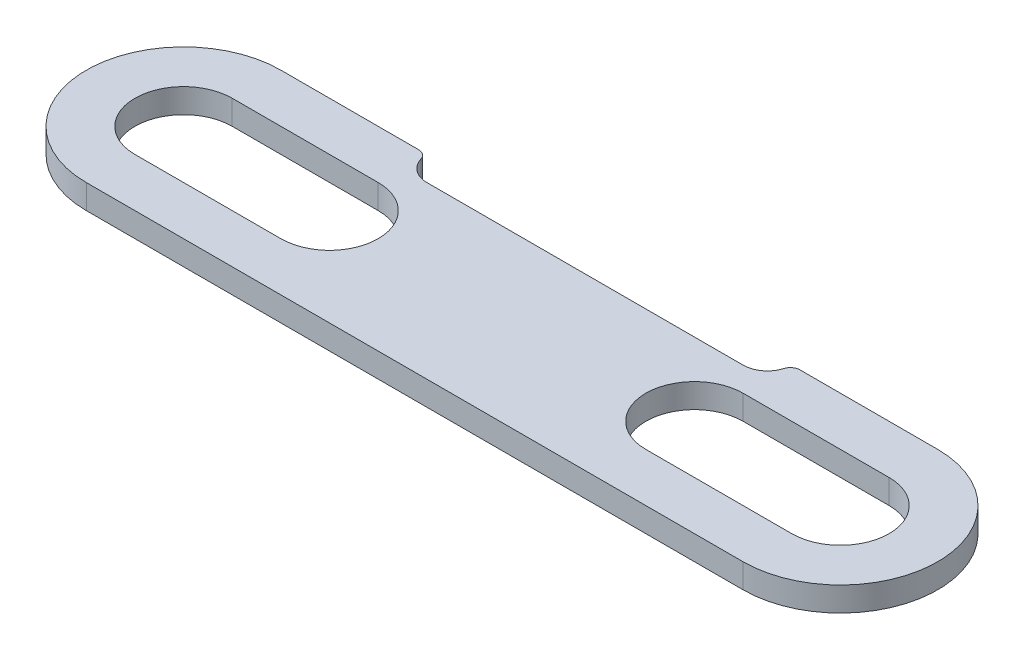
ISO-10303-21;
HEADER;
FILE_DESCRIPTION(('STEP AP214'),'2;1');
FILE_NAME('part.step','',(''),(''),'','','');
FILE_SCHEMA(('AUTOMOTIVE_DESIGN { 1 0 10303 214 1 1 1 1 }'));
ENDSEC;
DATA;
#1=APPLICATION_CONTEXT('core data for automotive mechanical design processes');
#2=APPLICATION_PROTOCOL_DEFINITION('international standard','automotive_design',2000,#1);
#3=PRODUCT_CONTEXT('',#1,'mechanical');
#4=PRODUCT('Part','Part','',(#3));
#5=PRODUCT_RELATED_PRODUCT_CATEGORY('part','',(#4));
#6=PRODUCT_DEFINITION_FORMATION('','',#4);
#7=PRODUCT_DEFINITION_CONTEXT('part definition',#1,'design');
#8=PRODUCT_DEFINITION('design','',#6,#7);
#9=PRODUCT_DEFINITION_SHAPE('','',#8);
#10=(LENGTH_UNIT() NAMED_UNIT(*) SI_UNIT(.MILLI.,.METRE.));
#11=(NAMED_UNIT(*) PLANE_ANGLE_UNIT() SI_UNIT($,.RADIAN.));
#12=(NAMED_UNIT(*) SI_UNIT($,.STERADIAN.) SOLID_ANGLE_UNIT());
#13=UNCERTAINTY_MEASURE_WITH_UNIT(LENGTH_MEASURE(1.E-05),#10,'distance_accuracy_value','');
#14=(GEOMETRIC_REPRESENTATION_CONTEXT(3) GLOBAL_UNCERTAINTY_ASSIGNED_CONTEXT((#13)) GLOBAL_UNIT_ASSIGNED_CONTEXT((#10,
#11,#12)) REPRESENTATION_CONTEXT('',''));
#15=CARTESIAN_POINT('',(0.,0.,0.));
#16=DIRECTION('',(0.,0.,1.));
#17=DIRECTION('',(1.,0.,0.));
#18=AXIS2_PLACEMENT_3D('',#15,#16,#17);
#19=CARTESIAN_POINT('',(-85.725,3.175,-25.4));
#20=DIRECTION('',(0.,0.,1.));
#21=DIRECTION('',(1.,0.,0.));
#22=AXIS2_PLACEMENT_3D('',#19,#20,#21);
#23=PLANE('',#22);
#24=DIRECTION('',(-1.,0.,0.));
#25=VECTOR('',#24,1.);
#26=CARTESIAN_POINT('',(-85.725,3.175,-25.4));
#27=LINE('',#26,#25);
#28=CARTESIAN_POINT('',(-49.7944189942742,3.175,-25.4));
#29=VERTEX_POINT('',#28);
#30=CARTESIAN_POINT('',(-85.725,3.175,-25.4));
#31=VERTEX_POINT('',#30);
#32=EDGE_CURVE('E260',#29,#31,#27,.T.);
#33=ORIENTED_EDGE('',*,*,#32,.F.);
#34=DIRECTION('',(0.,1.,0.));
#35=VECTOR('',#34,1.);
#36=CARTESIAN_POINT('',(-49.7944189942742,3.175,-25.4));
#37=LINE('',#36,#35);
#38=CARTESIAN_POINT('',(-49.7944189942742,-3.175,-25.4));
#39=VERTEX_POINT('',#38);
#40=EDGE_CURVE('E11',#29,#39,#37,.F.);
#41=ORIENTED_EDGE('',*,*,#40,.T.);
#42=DIRECTION('',(-1.,0.,0.));
#43=VECTOR('',#42,1.);
#44=CARTESIAN_POINT('',(-85.725,-3.175,-25.4));
#45=LINE('',#44,#43);
#46=CARTESIAN_POINT('',(-85.725,-3.175,-25.4));
#47=VERTEX_POINT('',#46);
#48=EDGE_CURVE('E271',#39,#47,#45,.T.);
#49=ORIENTED_EDGE('',*,*,#48,.T.);
#50=DIRECTION('',(0.,-1.,0.));
#51=VECTOR('',#50,1.);
#52=CARTESIAN_POINT('',(-85.725,3.175,-25.4));
#53=LINE('',#52,#51);
#54=EDGE_CURVE('E264',#31,#47,#53,.T.);
#55=ORIENTED_EDGE('',*,*,#54,.F.);
#56=EDGE_LOOP('',(#33,#41,#49,#55));
#57=FACE_BOUND('',#56,.T.);
#58=ADVANCED_FACE('F33',(#57),#23,.F.);
#59=CARTESIAN_POINT('',(-85.725,3.175,0.));
#60=DIRECTION('',(0.,1.,0.));
#61=DIRECTION('',(0.,0.,1.));
#62=AXIS2_PLACEMENT_3D('',#59,#60,#61);
#63=PLANE('',#62);
#64=CARTESIAN_POINT('',(85.725,3.175,-25.4000000000001));
#65=VERTEX_POINT('',#64);
#66=CARTESIAN_POINT('',(49.7944189942742,3.175,-25.4));
#67=VERTEX_POINT('',#66);
#68=EDGE_CURVE('E261',#65,#67,#27,.T.);
#69=ORIENTED_EDGE('',*,*,#68,.T.);
#70=CARTESIAN_POINT('',(49.7944189942742,3.175,-22.86));
#71=DIRECTION('',(0.,1.,0.));
#72=DIRECTION('',(0.,0.,1.));
#73=AXIS2_PLACEMENT_3D('',#70,#71,#72);
#74=CIRCLE('',#73,2.54);
#75=CARTESIAN_POINT('',(47.3602992816244,3.175,-23.5857142857143));
#76=VERTEX_POINT('',#75);
#77=EDGE_CURVE('E290',#67,#76,#74,.T.);
#78=ORIENTED_EDGE('',*,*,#77,.T.);
#79=CARTESIAN_POINT('',(41.275,3.175,-25.4));
#80=DIRECTION('',(0.,1.,0.));
#81=DIRECTION('',(0.,0.,1.));
#82=AXIS2_PLACEMENT_3D('',#79,#80,#81);
#83=CIRCLE('',#82,6.35);
#84=CARTESIAN_POINT('',(41.275,3.175,-19.05));
#85=VERTEX_POINT('',#84);
#86=EDGE_CURVE('E165',#85,#76,#83,.T.);
#87=ORIENTED_EDGE('',*,*,#86,.F.);
#88=DIRECTION('',(1.,0.,0.));
#89=VECTOR('',#88,1.);
#90=CARTESIAN_POINT('',(-41.275,3.175,-19.05));
#91=LINE('',#90,#89);
#92=CARTESIAN_POINT('',(-41.275,3.175,-19.05));
#93=VERTEX_POINT('',#92);
#94=EDGE_CURVE('E184',#93,#85,#91,.T.);
#95=ORIENTED_EDGE('',*,*,#94,.F.);
#96=CARTESIAN_POINT('',(-41.275,3.175,-25.4));
#97=DIRECTION('',(0.,1.,0.));
#98=DIRECTION('',(0.,0.,1.));
#99=AXIS2_PLACEMENT_3D('',#96,#97,#98);
#100=CIRCLE('',#99,6.35000000000002);
#101=CARTESIAN_POINT('',(-47.3602992816245,3.175,-23.5857142857143));
#102=VERTEX_POINT('',#101);
#103=EDGE_CURVE('E171',#102,#93,#100,.T.);
#104=ORIENTED_EDGE('',*,*,#103,.F.);
#105=CARTESIAN_POINT('',(-49.7944189942742,3.175,-22.86));
#106=DIRECTION('',(0.,1.,0.));
#107=DIRECTION('',(0.,0.,1.));
#108=AXIS2_PLACEMENT_3D('',#105,#106,#107);
#109=CIRCLE('',#108,2.54);
#110=EDGE_CURVE('E288',#102,#29,#109,.T.);
#111=ORIENTED_EDGE('',*,*,#110,.T.);
#112=ORIENTED_EDGE('',*,*,#32,.T.);
#113=CARTESIAN_POINT('',(-85.725,3.175,0.));
#114=DIRECTION('',(0.,1.,0.));
#115=DIRECTION('',(0.,0.,1.));
#116=AXIS2_PLACEMENT_3D('',#113,#114,#115);
#117=CIRCLE('',#116,25.4);
#118=CARTESIAN_POINT('',(-85.725,3.175,25.4));
#119=VERTEX_POINT('',#118);
#120=EDGE_CURVE('E252',#31,#119,#117,.T.);
#121=ORIENTED_EDGE('',*,*,#120,.T.);
#122=DIRECTION('',(1.,0.,0.));
#123=VECTOR('',#122,1.);
#124=CARTESIAN_POINT('',(-85.725,3.175,25.4));
#125=LINE('',#124,#123);
#126=CARTESIAN_POINT('',(85.725,3.175,25.4));
#127=VERTEX_POINT('',#126);
#128=EDGE_CURVE('E255',#119,#127,#125,.T.);
#129=ORIENTED_EDGE('',*,*,#128,.T.);
#130=CARTESIAN_POINT('',(85.725,3.175,0.));
#131=DIRECTION('',(0.,1.,0.));
#132=DIRECTION('',(0.,0.,1.));
#133=AXIS2_PLACEMENT_3D('',#130,#131,#132);
#134=CIRCLE('',#133,25.4);
#135=EDGE_CURVE('E258',#127,#65,#134,.T.);
#136=ORIENTED_EDGE('',*,*,#135,.T.);
#137=EDGE_LOOP('',(#69,#78,#87,#95,#104,#111,#112,#121,#129,#136));
#138=FACE_BOUND('',#137,.T.);
#139=DIRECTION('',(1.,0.,0.));
#140=VECTOR('',#139,1.);
#141=CARTESIAN_POINT('',(-85.725,3.175,12.7));
#142=LINE('',#141,#140);
#143=CARTESIAN_POINT('',(-85.725,3.175,12.7));
#144=VERTEX_POINT('',#143);
#145=CARTESIAN_POINT('',(-47.625,3.175,12.7));
#146=VERTEX_POINT('',#145);
#147=EDGE_CURVE('E223',#144,#146,#142,.T.);
#148=ORIENTED_EDGE('',*,*,#147,.F.);
#149=CARTESIAN_POINT('',(-85.725,3.175,0.));
#150=DIRECTION('',(0.,1.,0.));
#151=DIRECTION('',(0.,0.,1.));
#152=AXIS2_PLACEMENT_3D('',#149,#150,#151);
#153=CIRCLE('',#152,12.7);
#154=CARTESIAN_POINT('',(-85.725,3.175,-12.7));
#155=VERTEX_POINT('',#154);
#156=EDGE_CURVE('E221',#155,#144,#153,.T.);
#157=ORIENTED_EDGE('',*,*,#156,.F.);
#158=DIRECTION('',(-1.,0.,0.));
#159=VECTOR('',#158,1.);
#160=CARTESIAN_POINT('',(-85.725,3.175,-12.7));
#161=LINE('',#160,#159);
#162=CARTESIAN_POINT('',(-47.625,3.175,-12.7));
#163=VERTEX_POINT('',#162);
#164=EDGE_CURVE('E229',#163,#155,#161,.T.);
#165=ORIENTED_EDGE('',*,*,#164,.F.);
#166=CARTESIAN_POINT('',(-47.625,3.175,0.));
#167=DIRECTION('',(0.,1.,0.));
#168=DIRECTION('',(0.,0.,1.));
#169=AXIS2_PLACEMENT_3D('',#166,#167,#168);
#170=CIRCLE('',#169,12.7);
#171=EDGE_CURVE('E226',#146,#163,#170,.T.);
#172=ORIENTED_EDGE('',*,*,#171,.F.);
#173=EDGE_LOOP('',(#148,#157,#165,#172));
#174=FACE_BOUND('',#173,.T.);
#175=DIRECTION('',(-1.,0.,0.));
#176=VECTOR('',#175,1.);
#177=CARTESIAN_POINT('',(85.725,3.175,-12.7));
#178=LINE('',#177,#176);
#179=CARTESIAN_POINT('',(85.725,3.175,-12.7));
#180=VERTEX_POINT('',#179);
#181=CARTESIAN_POINT('',(47.625,3.175,-12.7));
#182=VERTEX_POINT('',#181);
#183=EDGE_CURVE('E192',#180,#182,#178,.T.);
#184=ORIENTED_EDGE('',*,*,#183,.F.);
#185=CARTESIAN_POINT('',(85.725,3.175,0.));
#186=DIRECTION('',(0.,1.,0.));
#187=DIRECTION('',(0.,0.,-1.));
#188=AXIS2_PLACEMENT_3D('',#185,#186,#187);
#189=CIRCLE('',#188,12.7);
#190=CARTESIAN_POINT('',(85.725,3.175,12.7));
#191=VERTEX_POINT('',#190);
#192=EDGE_CURVE('E190',#191,#180,#189,.T.);
#193=ORIENTED_EDGE('',*,*,#192,.F.);
#194=DIRECTION('',(1.,0.,0.));
#195=VECTOR('',#194,1.);
#196=CARTESIAN_POINT('',(85.725,3.175,12.7));
#197=LINE('',#196,#195);
#198=CARTESIAN_POINT('',(47.625,3.175,12.7));
#199=VERTEX_POINT('',#198);
#200=EDGE_CURVE('E198',#199,#191,#197,.T.);
#201=ORIENTED_EDGE('',*,*,#200,.F.);
#202=CARTESIAN_POINT('',(47.625,3.175,0.));
#203=DIRECTION('',(0.,1.,0.));
#204=DIRECTION('',(0.,0.,-1.));
#205=AXIS2_PLACEMENT_3D('',#202,#203,#204);
#206=CIRCLE('',#205,12.7);
#207=EDGE_CURVE('E195',#182,#199,#206,.T.);
#208=ORIENTED_EDGE('',*,*,#207,.F.);
#209=EDGE_LOOP('',(#184,#193,#201,#208));
#210=FACE_BOUND('',#209,.T.);
#211=ADVANCED_FACE('F298',(#138,#174,#210),#63,.T.);
#212=CARTESIAN_POINT('',(-85.725,-3.175,0.));
#213=DIRECTION('',(0.,1.,0.));
#214=DIRECTION('',(0.,0.,1.));
#215=AXIS2_PLACEMENT_3D('',#212,#213,#214);
#216=PLANE('',#215);
#217=CARTESIAN_POINT('',(41.275,-3.175,-25.4));
#218=DIRECTION('',(0.,1.,0.));
#219=DIRECTION('',(0.,0.,1.));
#220=AXIS2_PLACEMENT_3D('',#217,#218,#219);
#221=CIRCLE('',#220,6.35);
#222=CARTESIAN_POINT('',(41.275,-3.175,-19.05));
#223=VERTEX_POINT('',#222);
#224=CARTESIAN_POINT('',(47.3602992816244,-3.175,-23.5857142857143));
#225=VERTEX_POINT('',#224);
#226=EDGE_CURVE('E176',#223,#225,#221,.T.);
#227=ORIENTED_EDGE('',*,*,#226,.T.);
#228=CARTESIAN_POINT('',(49.7944189942742,-3.175,-22.86));
#229=DIRECTION('',(0.,1.,0.));
#230=DIRECTION('',(0.,0.,1.));
#231=AXIS2_PLACEMENT_3D('',#228,#229,#230);
#232=CIRCLE('',#231,2.54);
#233=CARTESIAN_POINT('',(49.7944189942742,-3.175,-25.4));
#234=VERTEX_POINT('',#233);
#235=EDGE_CURVE('E295',#225,#234,#232,.F.);
#236=ORIENTED_EDGE('',*,*,#235,.T.);
#237=CARTESIAN_POINT('',(85.725,-3.175,-25.4000000000001));
#238=VERTEX_POINT('',#237);
#239=EDGE_CURVE('E256',#238,#234,#45,.T.);
#240=ORIENTED_EDGE('',*,*,#239,.F.);
#241=CARTESIAN_POINT('',(85.725,-3.175,0.));
#242=DIRECTION('',(0.,1.,0.));
#243=DIRECTION('',(0.,0.,1.));
#244=AXIS2_PLACEMENT_3D('',#241,#242,#243);
#245=CIRCLE('',#244,25.4);
#246=CARTESIAN_POINT('',(85.725,-3.175,25.4));
#247=VERTEX_POINT('',#246);
#248=EDGE_CURVE('E269',#247,#238,#245,.T.);
#249=ORIENTED_EDGE('',*,*,#248,.F.);
#250=DIRECTION('',(1.,0.,0.));
#251=VECTOR('',#250,1.);
#252=CARTESIAN_POINT('',(-85.725,-3.175,25.4));
#253=LINE('',#252,#251);
#254=CARTESIAN_POINT('',(-85.725,-3.175,25.4));
#255=VERTEX_POINT('',#254);
#256=EDGE_CURVE('E267',#255,#247,#253,.T.);
#257=ORIENTED_EDGE('',*,*,#256,.F.);
#258=CARTESIAN_POINT('',(-85.725,-3.175,0.));
#259=DIRECTION('',(0.,1.,0.));
#260=DIRECTION('',(0.,0.,1.));
#261=AXIS2_PLACEMENT_3D('',#258,#259,#260);
#262=CIRCLE('',#261,25.4);
#263=EDGE_CURVE('E251',#47,#255,#262,.T.);
#264=ORIENTED_EDGE('',*,*,#263,.F.);
#265=ORIENTED_EDGE('',*,*,#48,.F.);
#266=CARTESIAN_POINT('',(-49.7944189942742,-3.175,-22.86));
#267=DIRECTION('',(0.,1.,0.));
#268=DIRECTION('',(0.,0.,1.));
#269=AXIS2_PLACEMENT_3D('',#266,#267,#268);
#270=CIRCLE('',#269,2.54);
#271=CARTESIAN_POINT('',(-47.3602992816245,-3.175,-23.5857142857143));
#272=VERTEX_POINT('',#271);
#273=EDGE_CURVE('E48',#39,#272,#270,.F.);
#274=ORIENTED_EDGE('',*,*,#273,.T.);
#275=CARTESIAN_POINT('',(-41.275,-3.175,-25.4));
#276=DIRECTION('',(0.,1.,0.));
#277=DIRECTION('',(0.,0.,1.));
#278=AXIS2_PLACEMENT_3D('',#275,#276,#277);
#279=CIRCLE('',#278,6.35000000000002);
#280=CARTESIAN_POINT('',(-41.275,-3.175,-19.05));
#281=VERTEX_POINT('',#280);
#282=EDGE_CURVE('E155',#272,#281,#279,.T.);
#283=ORIENTED_EDGE('',*,*,#282,.T.);
#284=DIRECTION('',(1.,0.,0.));
#285=VECTOR('',#284,1.);
#286=CARTESIAN_POINT('',(-41.275,-3.175,-19.05));
#287=LINE('',#286,#285);
#288=EDGE_CURVE('E161',#281,#223,#287,.T.);
#289=ORIENTED_EDGE('',*,*,#288,.T.);
#290=EDGE_LOOP('',(#227,#236,#240,#249,#257,#264,#265,#274,#283,#289));
#291=FACE_BOUND('',#290,.T.);
#292=CARTESIAN_POINT('',(-85.725,-3.175,0.));
#293=DIRECTION('',(0.,1.,0.));
#294=DIRECTION('',(0.,0.,1.));
#295=AXIS2_PLACEMENT_3D('',#292,#293,#294);
#296=CIRCLE('',#295,12.7);
#297=CARTESIAN_POINT('',(-85.725,-3.175,-12.7));
#298=VERTEX_POINT('',#297);
#299=CARTESIAN_POINT('',(-85.725,-3.175,12.7));
#300=VERTEX_POINT('',#299);
#301=EDGE_CURVE('E220',#298,#300,#296,.T.);
#302=ORIENTED_EDGE('',*,*,#301,.T.);
#303=DIRECTION('',(1.,0.,0.));
#304=VECTOR('',#303,1.);
#305=CARTESIAN_POINT('',(-85.725,-3.175,12.7));
#306=LINE('',#305,#304);
#307=CARTESIAN_POINT('',(-47.625,-3.175,12.7));
#308=VERTEX_POINT('',#307);
#309=EDGE_CURVE('E234',#300,#308,#306,.T.);
#310=ORIENTED_EDGE('',*,*,#309,.T.);
#311=CARTESIAN_POINT('',(-47.625,-3.175,0.));
#312=DIRECTION('',(0.,1.,0.));
#313=DIRECTION('',(0.,0.,1.));
#314=AXIS2_PLACEMENT_3D('',#311,#312,#313);
#315=CIRCLE('',#314,12.7);
#316=CARTESIAN_POINT('',(-47.625,-3.175,-12.7));
#317=VERTEX_POINT('',#316);
#318=EDGE_CURVE('E237',#308,#317,#315,.T.);
#319=ORIENTED_EDGE('',*,*,#318,.T.);
#320=DIRECTION('',(-1.,0.,0.));
#321=VECTOR('',#320,1.);
#322=CARTESIAN_POINT('',(-85.725,-3.175,-12.7));
#323=LINE('',#322,#321);
#324=EDGE_CURVE('E224',#317,#298,#323,.T.);
#325=ORIENTED_EDGE('',*,*,#324,.T.);
#326=EDGE_LOOP('',(#302,#310,#319,#325));
#327=FACE_BOUND('',#326,.T.);
#328=CARTESIAN_POINT('',(85.725,-3.175,0.));
#329=DIRECTION('',(0.,1.,0.));
#330=DIRECTION('',(0.,0.,-1.));
#331=AXIS2_PLACEMENT_3D('',#328,#329,#330);
#332=CIRCLE('',#331,12.7);
#333=CARTESIAN_POINT('',(85.725,-3.175,12.7));
#334=VERTEX_POINT('',#333);
#335=CARTESIAN_POINT('',(85.725,-3.175,-12.7));
#336=VERTEX_POINT('',#335);
#337=EDGE_CURVE('E188',#334,#336,#332,.T.);
#338=ORIENTED_EDGE('',*,*,#337,.T.);
#339=DIRECTION('',(-1.,0.,0.));
#340=VECTOR('',#339,1.);
#341=CARTESIAN_POINT('',(85.725,-3.175,-12.7));
#342=LINE('',#341,#340);
#343=CARTESIAN_POINT('',(47.625,-3.175,-12.7));
#344=VERTEX_POINT('',#343);
#345=EDGE_CURVE('E203',#336,#344,#342,.T.);
#346=ORIENTED_EDGE('',*,*,#345,.T.);
#347=CARTESIAN_POINT('',(47.625,-3.175,0.));
#348=DIRECTION('',(0.,1.,0.));
#349=DIRECTION('',(0.,0.,-1.));
#350=AXIS2_PLACEMENT_3D('',#347,#348,#349);
#351=CIRCLE('',#350,12.7);
#352=CARTESIAN_POINT('',(47.625,-3.175,12.7));
#353=VERTEX_POINT('',#352);
#354=EDGE_CURVE('E206',#344,#353,#351,.T.);
#355=ORIENTED_EDGE('',*,*,#354,.T.);
#356=DIRECTION('',(1.,0.,0.));
#357=VECTOR('',#356,1.);
#358=CARTESIAN_POINT('',(85.725,-3.175,12.7));
#359=LINE('',#358,#357);
#360=EDGE_CURVE('E193',#353,#334,#359,.T.);
#361=ORIENTED_EDGE('',*,*,#360,.T.);
#362=EDGE_LOOP('',(#338,#346,#355,#361));
#363=FACE_BOUND('',#362,.T.);
#364=ADVANCED_FACE('F158',(#291,#327,#363),#216,.F.);
#365=CARTESIAN_POINT('',(-85.725,3.175,0.));
#366=DIRECTION('',(0.,-1.,0.));
#367=DIRECTION('',(0.,0.,-1.));
#368=AXIS2_PLACEMENT_3D('',#365,#366,#367);
#369=CYLINDRICAL_SURFACE('',#368,25.4);
#370=ORIENTED_EDGE('',*,*,#263,.T.);
#371=DIRECTION('',(0.,-1.,0.));
#372=VECTOR('',#371,1.);
#373=CARTESIAN_POINT('',(-85.725,3.175,25.4));
#374=LINE('',#373,#372);
#375=EDGE_CURVE('E282',#119,#255,#374,.T.);
#376=ORIENTED_EDGE('',*,*,#375,.F.);
#377=ORIENTED_EDGE('',*,*,#120,.F.);
#378=ORIENTED_EDGE('',*,*,#54,.T.);
#379=EDGE_LOOP('',(#370,#376,#377,#378));
#380=FACE_BOUND('',#379,.T.);
#381=ADVANCED_FACE('F324',(#380),#369,.T.);
#382=CARTESIAN_POINT('',(-85.725,3.175,25.4));
#383=DIRECTION('',(0.,0.,-1.));
#384=DIRECTION('',(-1.,0.,0.));
#385=AXIS2_PLACEMENT_3D('',#382,#383,#384);
#386=PLANE('',#385);
#387=ORIENTED_EDGE('',*,*,#256,.T.);
#388=DIRECTION('',(0.,-1.,0.));
#389=VECTOR('',#388,1.);
#390=CARTESIAN_POINT('',(85.725,3.175,25.4));
#391=LINE('',#390,#389);
#392=EDGE_CURVE('E279',#127,#247,#391,.T.);
#393=ORIENTED_EDGE('',*,*,#392,.F.);
#394=ORIENTED_EDGE('',*,*,#128,.F.);
#395=ORIENTED_EDGE('',*,*,#375,.T.);
#396=EDGE_LOOP('',(#387,#393,#394,#395));
#397=FACE_BOUND('',#396,.T.);
#398=ADVANCED_FACE('F321',(#397),#386,.F.);
#399=CARTESIAN_POINT('',(85.725,3.175,0.));
#400=DIRECTION('',(0.,-1.,0.));
#401=DIRECTION('',(0.,0.,-1.));
#402=AXIS2_PLACEMENT_3D('',#399,#400,#401);
#403=CYLINDRICAL_SURFACE('',#402,25.4);
#404=ORIENTED_EDGE('',*,*,#248,.T.);
#405=DIRECTION('',(0.,-1.,0.));
#406=VECTOR('',#405,1.);
#407=CARTESIAN_POINT('',(85.725,3.175,-25.4000000000001));
#408=LINE('',#407,#406);
#409=EDGE_CURVE('E276',#65,#238,#408,.T.);
#410=ORIENTED_EDGE('',*,*,#409,.F.);
#411=ORIENTED_EDGE('',*,*,#135,.F.);
#412=ORIENTED_EDGE('',*,*,#392,.T.);
#413=EDGE_LOOP('',(#404,#410,#411,#412));
#414=FACE_BOUND('',#413,.T.);
#415=ADVANCED_FACE('F316',(#414),#403,.T.);
#416=ORIENTED_EDGE('',*,*,#239,.T.);
#417=DIRECTION('',(0.,1.,0.));
#418=VECTOR('',#417,1.);
#419=CARTESIAN_POINT('',(49.7944189942742,3.175,-25.4));
#420=LINE('',#419,#418);
#421=EDGE_CURVE('E285',#234,#67,#420,.T.);
#422=ORIENTED_EDGE('',*,*,#421,.T.);
#423=ORIENTED_EDGE('',*,*,#68,.F.);
#424=ORIENTED_EDGE('',*,*,#409,.T.);
#425=EDGE_LOOP('',(#416,#422,#423,#424));
#426=FACE_BOUND('',#425,.T.);
#427=ADVANCED_FACE('F311',(#426),#23,.F.);
#428=CARTESIAN_POINT('',(-85.725,3.175,0.));
#429=DIRECTION('',(0.,-1.,0.));
#430=DIRECTION('',(0.,0.,-1.));
#431=AXIS2_PLACEMENT_3D('',#428,#429,#430);
#432=CYLINDRICAL_SURFACE('',#431,12.7);
#433=ORIENTED_EDGE('',*,*,#301,.F.);
#434=DIRECTION('',(0.,-1.,0.));
#435=VECTOR('',#434,1.);
#436=CARTESIAN_POINT('',(-85.725,3.175,-12.7));
#437=LINE('',#436,#435);
#438=EDGE_CURVE('E231',#155,#298,#437,.T.);
#439=ORIENTED_EDGE('',*,*,#438,.F.);
#440=ORIENTED_EDGE('',*,*,#156,.T.);
#441=DIRECTION('',(0.,-1.,0.));
#442=VECTOR('',#441,1.);
#443=CARTESIAN_POINT('',(-85.725,3.175,12.7));
#444=LINE('',#443,#442);
#445=EDGE_CURVE('E248',#144,#300,#444,.T.);
#446=ORIENTED_EDGE('',*,*,#445,.T.);
#447=EDGE_LOOP('',(#433,#439,#440,#446));
#448=FACE_BOUND('',#447,.T.);
#449=ADVANCED_FACE('F339',(#448),#432,.F.);
#450=CARTESIAN_POINT('',(-85.725,3.175,12.7));
#451=DIRECTION('',(0.,0.,-1.));
#452=DIRECTION('',(-1.,0.,0.));
#453=AXIS2_PLACEMENT_3D('',#450,#451,#452);
#454=PLANE('',#453);
#455=ORIENTED_EDGE('',*,*,#309,.F.);
#456=ORIENTED_EDGE('',*,*,#445,.F.);
#457=ORIENTED_EDGE('',*,*,#147,.T.);
#458=DIRECTION('',(0.,-1.,0.));
#459=VECTOR('',#458,1.);
#460=CARTESIAN_POINT('',(-47.625,3.175,12.7));
#461=LINE('',#460,#459);
#462=EDGE_CURVE('E246',#146,#308,#461,.T.);
#463=ORIENTED_EDGE('',*,*,#462,.T.);
#464=EDGE_LOOP('',(#455,#456,#457,#463));
#465=FACE_BOUND('',#464,.T.);
#466=ADVANCED_FACE('F344',(#465),#454,.T.);
#467=CARTESIAN_POINT('',(-47.625,3.175,0.));
#468=DIRECTION('',(0.,-1.,0.));
#469=DIRECTION('',(0.,0.,-1.));
#470=AXIS2_PLACEMENT_3D('',#467,#468,#469);
#471=CYLINDRICAL_SURFACE('',#470,12.7);
#472=ORIENTED_EDGE('',*,*,#318,.F.);
#473=ORIENTED_EDGE('',*,*,#462,.F.);
#474=ORIENTED_EDGE('',*,*,#171,.T.);
#475=DIRECTION('',(0.,-1.,0.));
#476=VECTOR('',#475,1.);
#477=CARTESIAN_POINT('',(-47.625,3.175,-12.7));
#478=LINE('',#477,#476);
#479=EDGE_CURVE('E244',#163,#317,#478,.T.);
#480=ORIENTED_EDGE('',*,*,#479,.T.);
#481=EDGE_LOOP('',(#472,#473,#474,#480));
#482=FACE_BOUND('',#481,.T.);
#483=ADVANCED_FACE('F361',(#482),#471,.F.);
#484=CARTESIAN_POINT('',(-85.725,3.175,-12.7));
#485=DIRECTION('',(0.,0.,1.));
#486=DIRECTION('',(1.,0.,0.));
#487=AXIS2_PLACEMENT_3D('',#484,#485,#486);
#488=PLANE('',#487);
#489=ORIENTED_EDGE('',*,*,#324,.F.);
#490=ORIENTED_EDGE('',*,*,#479,.F.);
#491=ORIENTED_EDGE('',*,*,#164,.T.);
#492=ORIENTED_EDGE('',*,*,#438,.T.);
#493=EDGE_LOOP('',(#489,#490,#491,#492));
#494=FACE_BOUND('',#493,.T.);
#495=ADVANCED_FACE('F365',(#494),#488,.T.);
#496=CARTESIAN_POINT('',(85.725,3.175,0.));
#497=DIRECTION('',(0.,-1.,0.));
#498=DIRECTION('',(0.,0.,-1.));
#499=AXIS2_PLACEMENT_3D('',#496,#497,#498);
#500=CYLINDRICAL_SURFACE('',#499,12.7);
#501=ORIENTED_EDGE('',*,*,#337,.F.);
#502=DIRECTION('',(0.,-1.,0.));
#503=VECTOR('',#502,1.);
#504=CARTESIAN_POINT('',(85.725,3.175,12.7));
#505=LINE('',#504,#503);
#506=EDGE_CURVE('E200',#191,#334,#505,.T.);
#507=ORIENTED_EDGE('',*,*,#506,.F.);
#508=ORIENTED_EDGE('',*,*,#192,.T.);
#509=DIRECTION('',(0.,-1.,0.));
#510=VECTOR('',#509,1.);
#511=CARTESIAN_POINT('',(85.725,3.175,-12.7));
#512=LINE('',#511,#510);
#513=EDGE_CURVE('E217',#180,#336,#512,.T.);
#514=ORIENTED_EDGE('',*,*,#513,.T.);
#515=EDGE_LOOP('',(#501,#507,#508,#514));
#516=FACE_BOUND('',#515,.T.);
#517=ADVANCED_FACE('F369',(#516),#500,.F.);
#518=CARTESIAN_POINT('',(85.725,3.175,-12.7));
#519=DIRECTION('',(0.,0.,1.));
#520=DIRECTION('',(1.,0.,0.));
#521=AXIS2_PLACEMENT_3D('',#518,#519,#520);
#522=PLANE('',#521);
#523=ORIENTED_EDGE('',*,*,#345,.F.);
#524=ORIENTED_EDGE('',*,*,#513,.F.);
#525=ORIENTED_EDGE('',*,*,#183,.T.);
#526=DIRECTION('',(0.,-1.,0.));
#527=VECTOR('',#526,1.);
#528=CARTESIAN_POINT('',(47.625,3.175,-12.7));
#529=LINE('',#528,#527);
#530=EDGE_CURVE('E215',#182,#344,#529,.T.);
#531=ORIENTED_EDGE('',*,*,#530,.T.);
#532=EDGE_LOOP('',(#523,#524,#525,#531));
#533=FACE_BOUND('',#532,.T.);
#534=ADVANCED_FACE('F373',(#533),#522,.T.);
#535=CARTESIAN_POINT('',(47.625,3.175,0.));
#536=DIRECTION('',(0.,-1.,0.));
#537=DIRECTION('',(0.,0.,-1.));
#538=AXIS2_PLACEMENT_3D('',#535,#536,#537);
#539=CYLINDRICAL_SURFACE('',#538,12.7);
#540=ORIENTED_EDGE('',*,*,#354,.F.);
#541=ORIENTED_EDGE('',*,*,#530,.F.);
#542=ORIENTED_EDGE('',*,*,#207,.T.);
#543=DIRECTION('',(0.,-1.,0.));
#544=VECTOR('',#543,1.);
#545=CARTESIAN_POINT('',(47.625,3.175,12.7));
#546=LINE('',#545,#544);
#547=EDGE_CURVE('E213',#199,#353,#546,.T.);
#548=ORIENTED_EDGE('',*,*,#547,.T.);
#549=EDGE_LOOP('',(#540,#541,#542,#548));
#550=FACE_BOUND('',#549,.T.);
#551=ADVANCED_FACE('F377',(#550),#539,.F.);
#552=CARTESIAN_POINT('',(85.725,3.175,12.7));
#553=DIRECTION('',(0.,0.,-1.));
#554=DIRECTION('',(-1.,0.,0.));
#555=AXIS2_PLACEMENT_3D('',#552,#553,#554);
#556=PLANE('',#555);
#557=ORIENTED_EDGE('',*,*,#360,.F.);
#558=ORIENTED_EDGE('',*,*,#547,.F.);
#559=ORIENTED_EDGE('',*,*,#200,.T.);
#560=ORIENTED_EDGE('',*,*,#506,.T.);
#561=EDGE_LOOP('',(#557,#558,#559,#560));
#562=FACE_BOUND('',#561,.T.);
#563=ADVANCED_FACE('F381',(#562),#556,.T.);
#564=CARTESIAN_POINT('',(-41.275,-3.175,-25.4));
#565=DIRECTION('',(0.,1.,0.));
#566=DIRECTION('',(0.,0.,1.));
#567=AXIS2_PLACEMENT_3D('',#564,#565,#566);
#568=CYLINDRICAL_SURFACE('',#567,6.35000000000002);
#569=ORIENTED_EDGE('',*,*,#282,.F.);
#570=DIRECTION('',(0.,1.,0.));
#571=VECTOR('',#570,1.);
#572=CARTESIAN_POINT('',(-47.3602992816245,-3.175,-23.5857142857143));
#573=LINE('',#572,#571);
#574=EDGE_CURVE('E41',#272,#102,#573,.T.);
#575=ORIENTED_EDGE('',*,*,#574,.T.);
#576=ORIENTED_EDGE('',*,*,#103,.T.);
#577=DIRECTION('',(0.,1.,0.));
#578=VECTOR('',#577,1.);
#579=CARTESIAN_POINT('',(-41.275,-3.175,-19.05));
#580=LINE('',#579,#578);
#581=EDGE_CURVE('E168',#281,#93,#580,.T.);
#582=ORIENTED_EDGE('',*,*,#581,.F.);
#583=EDGE_LOOP('',(#569,#575,#576,#582));
#584=FACE_BOUND('',#583,.T.);
#585=ADVANCED_FACE('F169',(#584),#568,.F.);
#586=CARTESIAN_POINT('',(41.275,-3.175,-25.4));
#587=DIRECTION('',(0.,1.,0.));
#588=DIRECTION('',(0.,0.,1.));
#589=AXIS2_PLACEMENT_3D('',#586,#587,#588);
#590=CYLINDRICAL_SURFACE('',#589,6.35);
#591=ORIENTED_EDGE('',*,*,#86,.T.);
#592=DIRECTION('',(0.,1.,0.));
#593=VECTOR('',#592,1.);
#594=CARTESIAN_POINT('',(47.3602992816244,-3.175,-23.5857142857143));
#595=LINE('',#594,#593);
#596=EDGE_CURVE('E292',#76,#225,#595,.F.);
#597=ORIENTED_EDGE('',*,*,#596,.T.);
#598=ORIENTED_EDGE('',*,*,#226,.F.);
#599=DIRECTION('',(0.,1.,0.));
#600=VECTOR('',#599,1.);
#601=CARTESIAN_POINT('',(41.275,-3.175,-19.05));
#602=LINE('',#601,#600);
#603=EDGE_CURVE('E175',#223,#85,#602,.T.);
#604=ORIENTED_EDGE('',*,*,#603,.T.);
#605=EDGE_LOOP('',(#591,#597,#598,#604));
#606=FACE_BOUND('',#605,.T.);
#607=ADVANCED_FACE('F303',(#606),#590,.F.);
#608=CARTESIAN_POINT('',(-41.275,-3.175,-19.05));
#609=DIRECTION('',(0.,0.,1.));
#610=DIRECTION('',(1.,0.,0.));
#611=AXIS2_PLACEMENT_3D('',#608,#609,#610);
#612=PLANE('',#611);
#613=ORIENTED_EDGE('',*,*,#94,.T.);
#614=ORIENTED_EDGE('',*,*,#603,.F.);
#615=ORIENTED_EDGE('',*,*,#288,.F.);
#616=ORIENTED_EDGE('',*,*,#581,.T.);
#617=EDGE_LOOP('',(#613,#614,#615,#616));
#618=FACE_BOUND('',#617,.T.);
#619=ADVANCED_FACE('F178',(#618),#612,.F.);
#620=CARTESIAN_POINT('',(49.7944189942742,-3.175,-22.86));
#621=DIRECTION('',(0.,1.,0.));
#622=DIRECTION('',(0.,0.,1.));
#623=AXIS2_PLACEMENT_3D('',#620,#621,#622);
#624=CYLINDRICAL_SURFACE('',#623,2.54);
#625=ORIENTED_EDGE('',*,*,#235,.F.);
#626=ORIENTED_EDGE('',*,*,#596,.F.);
#627=ORIENTED_EDGE('',*,*,#77,.F.);
#628=ORIENTED_EDGE('',*,*,#421,.F.);
#629=EDGE_LOOP('',(#625,#626,#627,#628));
#630=FACE_BOUND('',#629,.T.);
#631=ADVANCED_FACE('F306',(#630),#624,.T.);
#632=CARTESIAN_POINT('',(-49.7944189942742,-3.175,-22.86));
#633=DIRECTION('',(0.,1.,0.));
#634=DIRECTION('',(0.,0.,1.));
#635=AXIS2_PLACEMENT_3D('',#632,#633,#634);
#636=CYLINDRICAL_SURFACE('',#635,2.54);
#637=ORIENTED_EDGE('',*,*,#273,.F.);
#638=ORIENTED_EDGE('',*,*,#40,.F.);
#639=ORIENTED_EDGE('',*,*,#110,.F.);
#640=ORIENTED_EDGE('',*,*,#574,.F.);
#641=EDGE_LOOP('',(#637,#638,#639,#640));
#642=FACE_BOUND('',#641,.T.);
#643=ADVANCED_FACE('F35',(#642),#636,.T.);
#644=CLOSED_SHELL('',(#58,#211,#364,#381,#398,#415,#427,#449,#466,#483,#495,#517,#534,#551,#563,
#585,#607,#619,#631,#643));
#645=MANIFOLD_SOLID_BREP('B2',#644);
#646=ADVANCED_BREP_SHAPE_REPRESENTATION('',(#18,#645),#14);
#647=SHAPE_DEFINITION_REPRESENTATION(#9,#646);
ENDSEC;
END-ISO-10303-21;
